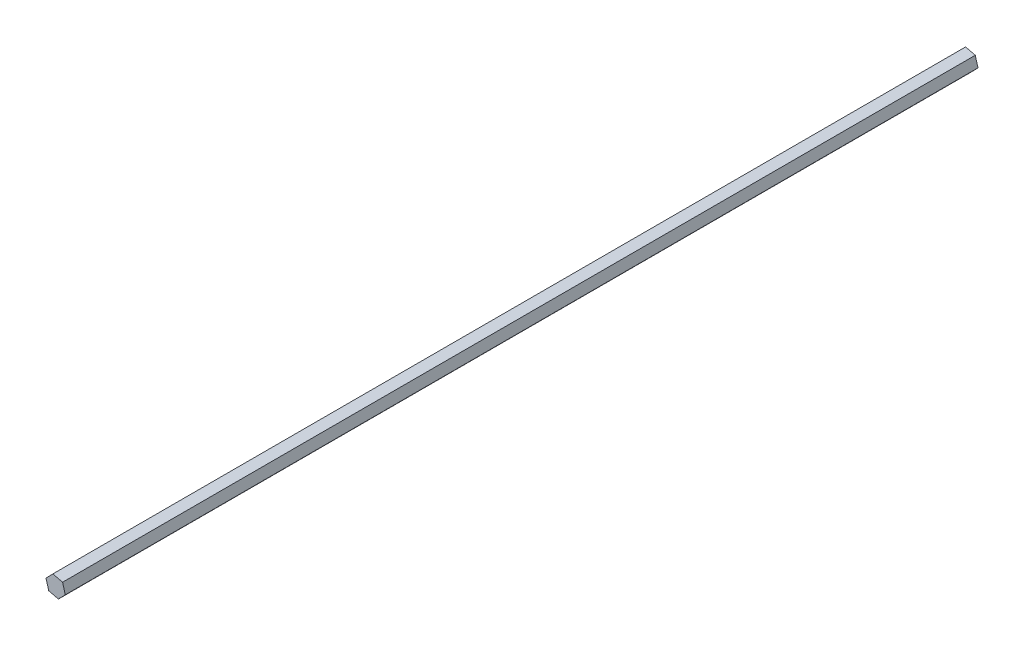
ISO-10303-21;
HEADER;
FILE_DESCRIPTION(('STEP AP214'),'2;1');
FILE_NAME('part.step','',(''),(''),'','','');
FILE_SCHEMA(('AUTOMOTIVE_DESIGN { 1 0 10303 214 1 1 1 1 }'));
ENDSEC;
DATA;
#1=APPLICATION_CONTEXT('core data for automotive mechanical design processes');
#2=APPLICATION_PROTOCOL_DEFINITION('international standard','automotive_design',2000,#1);
#3=PRODUCT_CONTEXT('',#1,'mechanical');
#4=PRODUCT('Part','Part','',(#3));
#5=PRODUCT_RELATED_PRODUCT_CATEGORY('part','',(#4));
#6=PRODUCT_DEFINITION_FORMATION('','',#4);
#7=PRODUCT_DEFINITION_CONTEXT('part definition',#1,'design');
#8=PRODUCT_DEFINITION('design','',#6,#7);
#9=PRODUCT_DEFINITION_SHAPE('','',#8);
#10=(LENGTH_UNIT() NAMED_UNIT(*) SI_UNIT(.MILLI.,.METRE.));
#11=(NAMED_UNIT(*) PLANE_ANGLE_UNIT() SI_UNIT($,.RADIAN.));
#12=(NAMED_UNIT(*) SI_UNIT($,.STERADIAN.) SOLID_ANGLE_UNIT());
#13=UNCERTAINTY_MEASURE_WITH_UNIT(LENGTH_MEASURE(1.E-05),#10,'distance_accuracy_value','');
#14=(GEOMETRIC_REPRESENTATION_CONTEXT(3) GLOBAL_UNCERTAINTY_ASSIGNED_CONTEXT((#13)) GLOBAL_UNIT_ASSIGNED_CONTEXT((#10,
#11,#12)) REPRESENTATION_CONTEXT('',''));
#15=CARTESIAN_POINT('',(0.,0.,0.));
#16=DIRECTION('',(0.,0.,1.));
#17=DIRECTION('',(1.,0.,0.));
#18=AXIS2_PLACEMENT_3D('',#15,#16,#17);
#19=CARTESIAN_POINT('',(-2.01661019445048,7.04958272928063,673.1));
#20=DIRECTION('',(0.718900237898645,-0.695113262676862,0.));
#21=DIRECTION('',(0.695113262676862,0.718900237898645,0.));
#22=AXIS2_PLACEMENT_3D('',#19,#20,#21);
#23=PLANE('',#22);
#24=DIRECTION('',(-0.695113262676862,-0.718900237898645,0.));
#25=VECTOR('',#24,1.);
#26=CARTESIAN_POINT('',(-2.01661019445048,7.04958272928063,0.));
#27=LINE('',#26,#25);
#28=CARTESIAN_POINT('',(-2.01661019445048,7.04958272928063,0.));
#29=VERTEX_POINT('',#28);
#30=CARTESIAN_POINT('',(-7.1134228268623,1.77835570671552,0.));
#31=VERTEX_POINT('',#30);
#32=EDGE_CURVE('E118',#29,#31,#27,.T.);
#33=ORIENTED_EDGE('',*,*,#32,.T.);
#34=DIRECTION('',(0.,0.,-1.));
#35=VECTOR('',#34,1.);
#36=CARTESIAN_POINT('',(-7.1134228268623,1.77835570671552,673.1));
#37=LINE('',#36,#35);
#38=CARTESIAN_POINT('',(-7.1134228268623,1.77835570671552,673.1));
#39=VERTEX_POINT('',#38);
#40=EDGE_CURVE('E11',#39,#31,#37,.T.);
#41=ORIENTED_EDGE('',*,*,#40,.F.);
#42=DIRECTION('',(-0.695113262676862,-0.718900237898645,0.));
#43=VECTOR('',#42,1.);
#44=CARTESIAN_POINT('',(-2.01661019445048,7.04958272928063,673.1));
#45=LINE('',#44,#43);
#46=CARTESIAN_POINT('',(-2.01661019445048,7.04958272928063,673.1));
#47=VERTEX_POINT('',#46);
#48=EDGE_CURVE('E128',#47,#39,#45,.T.);
#49=ORIENTED_EDGE('',*,*,#48,.F.);
#50=DIRECTION('',(0.,0.,-1.));
#51=VECTOR('',#50,1.);
#52=CARTESIAN_POINT('',(-2.01661019445048,7.04958272928063,673.1));
#53=LINE('',#52,#51);
#54=EDGE_CURVE('E114',#47,#29,#53,.T.);
#55=ORIENTED_EDGE('',*,*,#54,.T.);
#56=EDGE_LOOP('',(#33,#41,#49,#55));
#57=FACE_BOUND('',#56,.T.);
#58=ADVANCED_FACE('F34',(#57),#23,.F.);
#59=CARTESIAN_POINT('',(-7.1134228268623,1.77835570671552,673.1));
#60=DIRECTION('',(0.96143586293497,0.275029237468472,0.));
#61=DIRECTION('',(-0.275029237468472,0.96143586293497,0.));
#62=AXIS2_PLACEMENT_3D('',#59,#60,#61);
#63=PLANE('',#62);
#64=DIRECTION('',(0.275029237468472,-0.96143586293497,0.));
#65=VECTOR('',#64,1.);
#66=CARTESIAN_POINT('',(-7.1134228268623,1.77835570671552,0.));
#67=LINE('',#66,#65);
#68=CARTESIAN_POINT('',(-5.09681263241182,-5.27122702256511,0.));
#69=VERTEX_POINT('',#68);
#70=EDGE_CURVE('E121',#31,#69,#67,.T.);
#71=ORIENTED_EDGE('',*,*,#70,.T.);
#72=DIRECTION('',(0.,0.,-1.));
#73=VECTOR('',#72,1.);
#74=CARTESIAN_POINT('',(-5.09681263241182,-5.27122702256511,673.1));
#75=LINE('',#74,#73);
#76=CARTESIAN_POINT('',(-5.09681263241182,-5.27122702256511,673.1));
#77=VERTEX_POINT('',#76);
#78=EDGE_CURVE('E42',#77,#69,#75,.T.);
#79=ORIENTED_EDGE('',*,*,#78,.F.);
#80=DIRECTION('',(0.275029237468472,-0.96143586293497,0.));
#81=VECTOR('',#80,1.);
#82=CARTESIAN_POINT('',(-7.1134228268623,1.77835570671552,673.1));
#83=LINE('',#82,#81);
#84=EDGE_CURVE('E87',#39,#77,#83,.T.);
#85=ORIENTED_EDGE('',*,*,#84,.F.);
#86=ORIENTED_EDGE('',*,*,#40,.T.);
#87=EDGE_LOOP('',(#71,#79,#85,#86));
#88=FACE_BOUND('',#87,.T.);
#89=ADVANCED_FACE('F152',(#88),#63,.F.);
#90=CARTESIAN_POINT('',(-5.09681263241182,-5.27122702256511,673.1));
#91=DIRECTION('',(0.242535625036325,0.970142500145334,0.));
#92=DIRECTION('',(-0.970142500145334,0.242535625036325,0.));
#93=AXIS2_PLACEMENT_3D('',#90,#91,#92);
#94=PLANE('',#93);
#95=DIRECTION('',(0.970142500145334,-0.242535625036325,0.));
#96=VECTOR('',#95,1.);
#97=CARTESIAN_POINT('',(-5.09681263241182,-5.27122702256511,0.));
#98=LINE('',#97,#96);
#99=CARTESIAN_POINT('',(2.01661019445049,-7.04958272928063,0.));
#100=VERTEX_POINT('',#99);
#101=EDGE_CURVE('E123',#69,#100,#98,.T.);
#102=ORIENTED_EDGE('',*,*,#101,.T.);
#103=DIRECTION('',(0.,0.,-1.));
#104=VECTOR('',#103,1.);
#105=CARTESIAN_POINT('',(2.01661019445049,-7.04958272928063,673.1));
#106=LINE('',#105,#104);
#107=CARTESIAN_POINT('',(2.01661019445049,-7.04958272928063,673.1));
#108=VERTEX_POINT('',#107);
#109=EDGE_CURVE('E109',#108,#100,#106,.T.);
#110=ORIENTED_EDGE('',*,*,#109,.F.);
#111=DIRECTION('',(0.970142500145334,-0.242535625036325,0.));
#112=VECTOR('',#111,1.);
#113=CARTESIAN_POINT('',(-5.09681263241182,-5.27122702256511,673.1));
#114=LINE('',#113,#112);
#115=EDGE_CURVE('E100',#77,#108,#114,.T.);
#116=ORIENTED_EDGE('',*,*,#115,.F.);
#117=ORIENTED_EDGE('',*,*,#78,.T.);
#118=EDGE_LOOP('',(#102,#110,#116,#117));
#119=FACE_BOUND('',#118,.T.);
#120=ADVANCED_FACE('F134',(#119),#94,.F.);
#121=CARTESIAN_POINT('',(2.01661019445049,-7.04958272928063,673.1));
#122=DIRECTION('',(-0.718900237898645,0.695113262676862,0.));
#123=DIRECTION('',(-0.695113262676862,-0.718900237898645,0.));
#124=AXIS2_PLACEMENT_3D('',#121,#122,#123);
#125=PLANE('',#124);
#126=DIRECTION('',(0.695113262676862,0.718900237898645,0.));
#127=VECTOR('',#126,1.);
#128=CARTESIAN_POINT('',(2.01661019445049,-7.04958272928063,0.));
#129=LINE('',#128,#127);
#130=CARTESIAN_POINT('',(7.1134228268623,-1.77835570671552,0.));
#131=VERTEX_POINT('',#130);
#132=EDGE_CURVE('E108',#100,#131,#129,.T.);
#133=ORIENTED_EDGE('',*,*,#132,.T.);
#134=DIRECTION('',(0.,0.,-1.));
#135=VECTOR('',#134,1.);
#136=CARTESIAN_POINT('',(7.1134228268623,-1.77835570671552,673.1));
#137=LINE('',#136,#135);
#138=CARTESIAN_POINT('',(7.1134228268623,-1.77835570671552,673.1));
#139=VERTEX_POINT('',#138);
#140=EDGE_CURVE('E105',#139,#131,#137,.T.);
#141=ORIENTED_EDGE('',*,*,#140,.F.);
#142=DIRECTION('',(0.695113262676862,0.718900237898645,0.));
#143=VECTOR('',#142,1.);
#144=CARTESIAN_POINT('',(2.01661019445049,-7.04958272928063,673.1));
#145=LINE('',#144,#143);
#146=EDGE_CURVE('E94',#108,#139,#145,.T.);
#147=ORIENTED_EDGE('',*,*,#146,.F.);
#148=ORIENTED_EDGE('',*,*,#109,.T.);
#149=EDGE_LOOP('',(#133,#141,#147,#148));
#150=FACE_BOUND('',#149,.T.);
#151=ADVANCED_FACE('F106',(#150),#125,.F.);
#152=CARTESIAN_POINT('',(7.1134228268623,-1.77835570671552,673.1));
#153=DIRECTION('',(-0.96143586293497,-0.275029237468472,0.));
#154=DIRECTION('',(0.275029237468472,-0.96143586293497,0.));
#155=AXIS2_PLACEMENT_3D('',#152,#153,#154);
#156=PLANE('',#155);
#157=DIRECTION('',(-0.275029237468472,0.96143586293497,0.));
#158=VECTOR('',#157,1.);
#159=CARTESIAN_POINT('',(7.1134228268623,-1.77835570671552,0.));
#160=LINE('',#159,#158);
#161=CARTESIAN_POINT('',(5.09681263241182,5.27122702256512,0.));
#162=VERTEX_POINT('',#161);
#163=EDGE_CURVE('E73',#131,#162,#160,.T.);
#164=ORIENTED_EDGE('',*,*,#163,.T.);
#165=DIRECTION('',(0.,0.,-1.));
#166=VECTOR('',#165,1.);
#167=CARTESIAN_POINT('',(5.09681263241182,5.27122702256512,673.1));
#168=LINE('',#167,#166);
#169=CARTESIAN_POINT('',(5.09681263241182,5.27122702256512,673.1));
#170=VERTEX_POINT('',#169);
#171=EDGE_CURVE('E110',#170,#162,#168,.T.);
#172=ORIENTED_EDGE('',*,*,#171,.F.);
#173=DIRECTION('',(-0.275029237468472,0.96143586293497,0.));
#174=VECTOR('',#173,1.);
#175=CARTESIAN_POINT('',(7.1134228268623,-1.77835570671552,673.1));
#176=LINE('',#175,#174);
#177=EDGE_CURVE('E98',#139,#170,#176,.T.);
#178=ORIENTED_EDGE('',*,*,#177,.F.);
#179=ORIENTED_EDGE('',*,*,#140,.T.);
#180=EDGE_LOOP('',(#164,#172,#178,#179));
#181=FACE_BOUND('',#180,.T.);
#182=ADVANCED_FACE('F112',(#181),#156,.F.);
#183=CARTESIAN_POINT('',(5.09681263241182,5.27122702256512,673.1));
#184=DIRECTION('',(-0.242535625036325,-0.970142500145334,0.));
#185=DIRECTION('',(0.970142500145334,-0.242535625036325,0.));
#186=AXIS2_PLACEMENT_3D('',#183,#184,#185);
#187=PLANE('',#186);
#188=DIRECTION('',(-0.970142500145334,0.242535625036325,0.));
#189=VECTOR('',#188,1.);
#190=CARTESIAN_POINT('',(5.09681263241182,5.27122702256512,0.));
#191=LINE('',#190,#189);
#192=EDGE_CURVE('E79',#162,#29,#191,.T.);
#193=ORIENTED_EDGE('',*,*,#192,.T.);
#194=ORIENTED_EDGE('',*,*,#54,.F.);
#195=DIRECTION('',(-0.970142500145334,0.242535625036325,0.));
#196=VECTOR('',#195,1.);
#197=CARTESIAN_POINT('',(5.09681263241182,5.27122702256512,673.1));
#198=LINE('',#197,#196);
#199=EDGE_CURVE('E50',#170,#47,#198,.T.);
#200=ORIENTED_EDGE('',*,*,#199,.F.);
#201=ORIENTED_EDGE('',*,*,#171,.T.);
#202=EDGE_LOOP('',(#193,#194,#200,#201));
#203=FACE_BOUND('',#202,.T.);
#204=ADVANCED_FACE('F141',(#203),#187,.F.);
#205=CARTESIAN_POINT('',(0.,0.,673.1));
#206=DIRECTION('',(0.,0.,1.));
#207=DIRECTION('',(1.,0.,0.));
#208=AXIS2_PLACEMENT_3D('',#205,#206,#207);
#209=PLANE('',#208);
#210=ORIENTED_EDGE('',*,*,#48,.T.);
#211=ORIENTED_EDGE('',*,*,#84,.T.);
#212=ORIENTED_EDGE('',*,*,#115,.T.);
#213=ORIENTED_EDGE('',*,*,#146,.T.);
#214=ORIENTED_EDGE('',*,*,#177,.T.);
#215=ORIENTED_EDGE('',*,*,#199,.T.);
#216=EDGE_LOOP('',(#210,#211,#212,#213,#214,#215));
#217=FACE_BOUND('',#216,.T.);
#218=ADVANCED_FACE('F96',(#217),#209,.T.);
#219=CARTESIAN_POINT('',(0.,0.,0.));
#220=DIRECTION('',(0.,0.,1.));
#221=DIRECTION('',(1.,0.,0.));
#222=AXIS2_PLACEMENT_3D('',#219,#220,#221);
#223=PLANE('',#222);
#224=ORIENTED_EDGE('',*,*,#32,.F.);
#225=ORIENTED_EDGE('',*,*,#192,.F.);
#226=ORIENTED_EDGE('',*,*,#163,.F.);
#227=ORIENTED_EDGE('',*,*,#132,.F.);
#228=ORIENTED_EDGE('',*,*,#101,.F.);
#229=ORIENTED_EDGE('',*,*,#70,.F.);
#230=EDGE_LOOP('',(#224,#225,#226,#227,#228,#229));
#231=FACE_BOUND('',#230,.T.);
#232=ADVANCED_FACE('F137',(#231),#223,.F.);
#233=CLOSED_SHELL('',(#58,#89,#120,#151,#182,#204,#218,#232));
#234=MANIFOLD_SOLID_BREP('B2',#233);
#235=ADVANCED_BREP_SHAPE_REPRESENTATION('',(#18,#234),#14);
#236=SHAPE_DEFINITION_REPRESENTATION(#9,#235);
ENDSEC;
END-ISO-10303-21;
